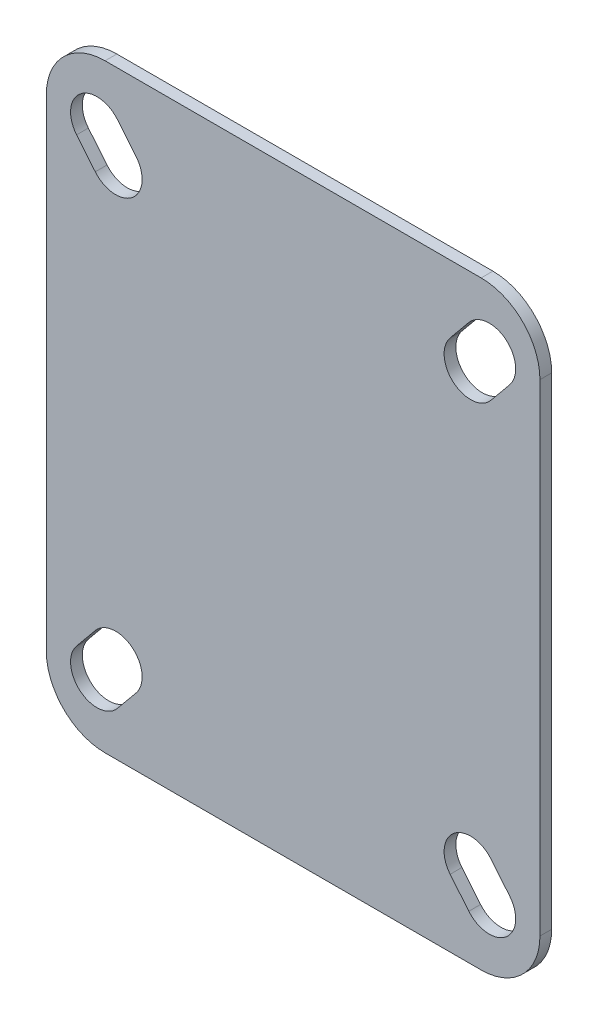
ISO-10303-21;
HEADER;
FILE_DESCRIPTION(('STEP AP214'),'2;1');
FILE_NAME('part.step','',(''),(''),'','','');
FILE_SCHEMA(('AUTOMOTIVE_DESIGN { 1 0 10303 214 1 1 1 1 }'));
ENDSEC;
DATA;
#1=APPLICATION_CONTEXT('core data for automotive mechanical design processes');
#2=APPLICATION_PROTOCOL_DEFINITION('international standard','automotive_design',2000,#1);
#3=PRODUCT_CONTEXT('',#1,'mechanical');
#4=PRODUCT('Part','Part','',(#3));
#5=PRODUCT_RELATED_PRODUCT_CATEGORY('part','',(#4));
#6=PRODUCT_DEFINITION_FORMATION('','',#4);
#7=PRODUCT_DEFINITION_CONTEXT('part definition',#1,'design');
#8=PRODUCT_DEFINITION('design','',#6,#7);
#9=PRODUCT_DEFINITION_SHAPE('','',#8);
#10=(LENGTH_UNIT() NAMED_UNIT(*) SI_UNIT(.MILLI.,.METRE.));
#11=(NAMED_UNIT(*) PLANE_ANGLE_UNIT() SI_UNIT($,.RADIAN.));
#12=(NAMED_UNIT(*) SI_UNIT($,.STERADIAN.) SOLID_ANGLE_UNIT());
#13=UNCERTAINTY_MEASURE_WITH_UNIT(LENGTH_MEASURE(1.E-05),#10,'distance_accuracy_value','');
#14=(GEOMETRIC_REPRESENTATION_CONTEXT(3) GLOBAL_UNCERTAINTY_ASSIGNED_CONTEXT((#13)) GLOBAL_UNIT_ASSIGNED_CONTEXT((#10,
#11,#12)) REPRESENTATION_CONTEXT('',''));
#15=CARTESIAN_POINT('',(0.,0.,0.));
#16=DIRECTION('',(0.,0.,1.));
#17=DIRECTION('',(1.,0.,0.));
#18=AXIS2_PLACEMENT_3D('',#15,#16,#17);
#19=CARTESIAN_POINT('',(0.,27.7552809045647,0.));
#20=DIRECTION('',(0.,0.,1.));
#21=DIRECTION('',(1.,0.,0.));
#22=AXIS2_PLACEMENT_3D('',#19,#20,#21);
#23=CONICAL_SURFACE('',#22,27.4999999999999,0.279252680319093);
#24=CARTESIAN_POINT('',(0.,27.7552809045647,6.));
#25=DIRECTION('',(0.,0.,1.));
#26=DIRECTION('',(1.,0.,0.));
#27=AXIS2_PLACEMENT_3D('',#24,#25,#26);
#28=CIRCLE('',#27,29.2204723145527);
#29=CARTESIAN_POINT('',(29.2204723145527,27.7552809045647,6.));
#30=VERTEX_POINT('',#29);
#31=EDGE_CURVE('E13',#30,#30,#28,.T.);
#32=ORIENTED_EDGE('',*,*,#31,.F.);
#33=EDGE_LOOP('',(#32));
#34=FACE_BOUND('',#33,.T.);
#35=CARTESIAN_POINT('',(0.,27.7552809045647,0.));
#36=DIRECTION('',(0.,0.,1.));
#37=DIRECTION('',(1.,0.,0.));
#38=AXIS2_PLACEMENT_3D('',#35,#36,#37);
#39=CIRCLE('',#38,27.4999999999999);
#40=CARTESIAN_POINT('',(27.4999999999999,27.7552809045647,0.));
#41=VERTEX_POINT('',#40);
#42=EDGE_CURVE('E53',#41,#41,#39,.T.);
#43=ORIENTED_EDGE('',*,*,#42,.T.);
#44=EDGE_LOOP('',(#43));
#45=FACE_BOUND('',#44,.T.);
#46=ADVANCED_FACE('F46',(#34,#45),#23,.T.);
#47=CARTESIAN_POINT('',(0.,27.7552809045647,0.));
#48=DIRECTION('',(0.,0.,1.));
#49=DIRECTION('',(1.,0.,0.));
#50=AXIS2_PLACEMENT_3D('',#47,#48,#49);
#51=PLANE('',#50);
#52=ORIENTED_EDGE('',*,*,#42,.F.);
#53=EDGE_LOOP('',(#52));
#54=FACE_BOUND('',#53,.T.);
#55=ADVANCED_FACE('F396',(#54),#51,.F.);
#56=CARTESIAN_POINT('',(-32.,68.7552809045647,8.));
#57=DIRECTION('',(0.,0.,1.));
#58=DIRECTION('',(1.,0.,0.));
#59=AXIS2_PLACEMENT_3D('',#56,#57,#58);
#60=PLANE('',#59);
#61=CARTESIAN_POINT('',(-32.,68.7552809045647,8.));
#62=DIRECTION('',(0.,0.,1.));
#63=DIRECTION('',(1.,0.,0.));
#64=AXIS2_PLACEMENT_3D('',#61,#62,#63);
#65=CIRCLE('',#64,9.99999999999999);
#66=CARTESIAN_POINT('',(-32.,78.7552809045646,8.));
#67=VERTEX_POINT('',#66);
#68=CARTESIAN_POINT('',(-42.,68.7552809045647,8.));
#69=VERTEX_POINT('',#68);
#70=EDGE_CURVE('E336',#67,#69,#65,.T.);
#71=ORIENTED_EDGE('',*,*,#70,.T.);
#72=DIRECTION('',(0.,-1.,0.));
#73=VECTOR('',#72,1.);
#74=CARTESIAN_POINT('',(-42.,68.7552809045647,8.));
#75=LINE('',#74,#73);
#76=CARTESIAN_POINT('',(-42.,-13.2447190954353,8.));
#77=VERTEX_POINT('',#76);
#78=EDGE_CURVE('E339',#69,#77,#75,.T.);
#79=ORIENTED_EDGE('',*,*,#78,.T.);
#80=CARTESIAN_POINT('',(-32.,-13.2447190954353,8.));
#81=DIRECTION('',(0.,0.,1.));
#82=DIRECTION('',(1.,0.,0.));
#83=AXIS2_PLACEMENT_3D('',#80,#81,#82);
#84=CIRCLE('',#83,10.);
#85=CARTESIAN_POINT('',(-32.,-23.2447190954353,8.));
#86=VERTEX_POINT('',#85);
#87=EDGE_CURVE('E342',#77,#86,#84,.T.);
#88=ORIENTED_EDGE('',*,*,#87,.T.);
#89=DIRECTION('',(1.,0.,0.));
#90=VECTOR('',#89,1.);
#91=CARTESIAN_POINT('',(-32.,-23.2447190954353,8.));
#92=LINE('',#91,#90);
#93=CARTESIAN_POINT('',(32.,-23.2447190954353,8.));
#94=VERTEX_POINT('',#93);
#95=EDGE_CURVE('E344',#86,#94,#92,.T.);
#96=ORIENTED_EDGE('',*,*,#95,.T.);
#97=CARTESIAN_POINT('',(32.,-13.2447190954353,8.));
#98=DIRECTION('',(0.,0.,1.));
#99=DIRECTION('',(1.,0.,0.));
#100=AXIS2_PLACEMENT_3D('',#97,#98,#99);
#101=CIRCLE('',#100,10.);
#102=CARTESIAN_POINT('',(42.,-13.2447190954353,8.));
#103=VERTEX_POINT('',#102);
#104=EDGE_CURVE('E346',#94,#103,#101,.T.);
#105=ORIENTED_EDGE('',*,*,#104,.T.);
#106=DIRECTION('',(0.,1.,0.));
#107=VECTOR('',#106,1.);
#108=CARTESIAN_POINT('',(42.,68.7552809045647,8.));
#109=LINE('',#108,#107);
#110=CARTESIAN_POINT('',(42.,68.7552809045647,8.));
#111=VERTEX_POINT('',#110);
#112=EDGE_CURVE('E348',#103,#111,#109,.T.);
#113=ORIENTED_EDGE('',*,*,#112,.T.);
#114=CARTESIAN_POINT('',(32.,68.7552809045647,8.));
#115=DIRECTION('',(0.,0.,1.));
#116=DIRECTION('',(-1.,0.,0.));
#117=AXIS2_PLACEMENT_3D('',#114,#115,#116);
#118=CIRCLE('',#117,9.99999999999999);
#119=CARTESIAN_POINT('',(32.,78.7552809045646,8.));
#120=VERTEX_POINT('',#119);
#121=EDGE_CURVE('E350',#111,#120,#118,.T.);
#122=ORIENTED_EDGE('',*,*,#121,.T.);
#123=DIRECTION('',(-1.,0.,0.));
#124=VECTOR('',#123,1.);
#125=CARTESIAN_POINT('',(-32.,78.7552809045646,8.));
#126=LINE('',#125,#124);
#127=EDGE_CURVE('E352',#120,#67,#126,.T.);
#128=ORIENTED_EDGE('',*,*,#127,.T.);
#129=EDGE_LOOP('',(#71,#79,#88,#96,#105,#113,#122,#128));
#130=FACE_BOUND('',#129,.T.);
#131=DIRECTION('',(0.635707252861111,-0.77193023561704,0.));
#132=VECTOR('',#131,1.);
#133=CARTESIAN_POINT('',(-36.8483168354845,65.4209356365848,8.));
#134=LINE('',#133,#132);
#135=CARTESIAN_POINT('',(-36.8483168354845,65.4209356365848,8.));
#136=VERTEX_POINT('',#135);
#137=CARTESIAN_POINT('',(-33.669780571179,61.5612844584996,8.));
#138=VERTEX_POINT('',#137);
#139=EDGE_CURVE('E307',#136,#138,#134,.T.);
#140=ORIENTED_EDGE('',*,*,#139,.F.);
#141=CARTESIAN_POINT('',(-33.3746307752077,68.2816182744598,8.));
#142=DIRECTION('',(0.,0.,1.));
#143=DIRECTION('',(1.,0.,0.));
#144=AXIS2_PLACEMENT_3D('',#141,#142,#143);
#145=CIRCLE('',#144,4.49999999999997);
#146=CARTESIAN_POINT('',(-29.9009447149311,71.1423009123347,8.));
#147=VERTEX_POINT('',#146);
#148=EDGE_CURVE('E305',#147,#136,#145,.T.);
#149=ORIENTED_EDGE('',*,*,#148,.F.);
#150=DIRECTION('',(-0.635707252861109,0.771930235617042,0.));
#151=VECTOR('',#150,1.);
#152=CARTESIAN_POINT('',(-29.9009447149311,71.1423009123347,8.));
#153=LINE('',#152,#151);
#154=CARTESIAN_POINT('',(-26.7224084506255,67.2826497342495,8.));
#155=VERTEX_POINT('',#154);
#156=EDGE_CURVE('E313',#155,#147,#153,.T.);
#157=ORIENTED_EDGE('',*,*,#156,.F.);
#158=CARTESIAN_POINT('',(-30.1960945109022,64.4219670963745,8.));
#159=DIRECTION('',(0.,0.,1.));
#160=DIRECTION('',(1.,0.,0.));
#161=AXIS2_PLACEMENT_3D('',#158,#159,#160);
#162=CIRCLE('',#161,4.49999999999997);
#163=EDGE_CURVE('E310',#138,#155,#162,.T.);
#164=ORIENTED_EDGE('',*,*,#163,.F.);
#165=EDGE_LOOP('',(#140,#149,#157,#164));
#166=FACE_BOUND('',#165,.T.);
#167=DIRECTION('',(-0.635707252861103,-0.771930235617047,0.));
#168=VECTOR('',#167,1.);
#169=CARTESIAN_POINT('',(29.900944714931,71.1423009123347,8.));
#170=LINE('',#169,#168);
#171=CARTESIAN_POINT('',(29.900944714931,71.1423009123347,8.));
#172=VERTEX_POINT('',#171);
#173=CARTESIAN_POINT('',(26.7224084506255,67.2826497342495,8.));
#174=VERTEX_POINT('',#173);
#175=EDGE_CURVE('E276',#172,#174,#170,.T.);
#176=ORIENTED_EDGE('',*,*,#175,.F.);
#177=CARTESIAN_POINT('',(33.3746307752077,68.2816182744598,8.));
#178=DIRECTION('',(0.,0.,1.));
#179=DIRECTION('',(1.,0.,0.));
#180=AXIS2_PLACEMENT_3D('',#177,#178,#179);
#181=CIRCLE('',#180,4.49999999999999);
#182=CARTESIAN_POINT('',(36.8483168354844,65.4209356365848,8.));
#183=VERTEX_POINT('',#182);
#184=EDGE_CURVE('E274',#183,#172,#181,.T.);
#185=ORIENTED_EDGE('',*,*,#184,.F.);
#186=DIRECTION('',(0.635707252861101,0.771930235617048,0.));
#187=VECTOR('',#186,1.);
#188=CARTESIAN_POINT('',(36.8483168354844,65.4209356365848,8.));
#189=LINE('',#188,#187);
#190=CARTESIAN_POINT('',(33.6697805711789,61.5612844584996,8.));
#191=VERTEX_POINT('',#190);
#192=EDGE_CURVE('E282',#191,#183,#189,.T.);
#193=ORIENTED_EDGE('',*,*,#192,.F.);
#194=CARTESIAN_POINT('',(30.1960945109022,64.4219670963745,8.));
#195=DIRECTION('',(0.,0.,1.));
#196=DIRECTION('',(1.,0.,0.));
#197=AXIS2_PLACEMENT_3D('',#194,#195,#196);
#198=CIRCLE('',#197,4.5);
#199=EDGE_CURVE('E279',#174,#191,#198,.T.);
#200=ORIENTED_EDGE('',*,*,#199,.F.);
#201=EDGE_LOOP('',(#176,#185,#193,#200));
#202=FACE_BOUND('',#201,.T.);
#203=DIRECTION('',(-0.63570725286113,0.771930235617025,0.));
#204=VECTOR('',#203,1.);
#205=CARTESIAN_POINT('',(36.8483168354845,-9.9103738274554,8.));
#206=LINE('',#205,#204);
#207=CARTESIAN_POINT('',(36.8483168354845,-9.9103738274554,8.));
#208=VERTEX_POINT('',#207);
#209=CARTESIAN_POINT('',(33.6697805711789,-6.05072264937023,8.));
#210=VERTEX_POINT('',#209);
#211=EDGE_CURVE('E245',#208,#210,#206,.T.);
#212=ORIENTED_EDGE('',*,*,#211,.F.);
#213=CARTESIAN_POINT('',(33.3746307752077,-12.7710564653304,8.));
#214=DIRECTION('',(0.,0.,1.));
#215=DIRECTION('',(1.,0.,0.));
#216=AXIS2_PLACEMENT_3D('',#213,#214,#215);
#217=CIRCLE('',#216,4.50000000000004);
#218=CARTESIAN_POINT('',(29.900944714931,-15.6317391032053,8.));
#219=VERTEX_POINT('',#218);
#220=EDGE_CURVE('E243',#219,#208,#217,.T.);
#221=ORIENTED_EDGE('',*,*,#220,.F.);
#222=DIRECTION('',(0.635707252861104,-0.771930235617046,0.));
#223=VECTOR('',#222,1.);
#224=CARTESIAN_POINT('',(29.900944714931,-15.6317391032053,8.));
#225=LINE('',#224,#223);
#226=CARTESIAN_POINT('',(26.7224084506255,-11.7720879251201,8.));
#227=VERTEX_POINT('',#226);
#228=EDGE_CURVE('E251',#227,#219,#225,.T.);
#229=ORIENTED_EDGE('',*,*,#228,.F.);
#230=CARTESIAN_POINT('',(30.1960945109022,-8.91140528724514,8.));
#231=DIRECTION('',(0.,0.,1.));
#232=DIRECTION('',(1.,0.,0.));
#233=AXIS2_PLACEMENT_3D('',#230,#231,#232);
#234=CIRCLE('',#233,4.49999999999995);
#235=EDGE_CURVE('E248',#210,#227,#234,.T.);
#236=ORIENTED_EDGE('',*,*,#235,.F.);
#237=EDGE_LOOP('',(#212,#221,#229,#236));
#238=FACE_BOUND('',#237,.T.);
#239=DIRECTION('',(0.635707252861099,0.77193023561705,0.));
#240=VECTOR('',#239,1.);
#241=CARTESIAN_POINT('',(-29.900944714931,-15.6317391032053,8.));
#242=LINE('',#241,#240);
#243=CARTESIAN_POINT('',(-29.900944714931,-15.6317391032053,8.));
#244=VERTEX_POINT('',#243);
#245=CARTESIAN_POINT('',(-26.7224084506255,-11.7720879251201,8.));
#246=VERTEX_POINT('',#245);
#247=EDGE_CURVE('E214',#244,#246,#242,.T.);
#248=ORIENTED_EDGE('',*,*,#247,.F.);
#249=CARTESIAN_POINT('',(-33.3746307752077,-12.7710564653304,8.));
#250=DIRECTION('',(0.,0.,1.));
#251=DIRECTION('',(1.,0.,0.));
#252=AXIS2_PLACEMENT_3D('',#249,#250,#251);
#253=CIRCLE('',#252,4.49999999999998);
#254=CARTESIAN_POINT('',(-36.8483168354844,-9.91037382745546,8.));
#255=VERTEX_POINT('',#254);
#256=EDGE_CURVE('E206',#255,#244,#253,.T.);
#257=ORIENTED_EDGE('',*,*,#256,.F.);
#258=DIRECTION('',(-0.635707252861099,-0.77193023561705,0.));
#259=VECTOR('',#258,1.);
#260=CARTESIAN_POINT('',(-36.8483168354844,-9.91037382745546,8.));
#261=LINE('',#260,#259);
#262=CARTESIAN_POINT('',(-33.6697805711789,-6.05072264937021,8.));
#263=VERTEX_POINT('',#262);
#264=EDGE_CURVE('E229',#263,#255,#261,.T.);
#265=ORIENTED_EDGE('',*,*,#264,.F.);
#266=CARTESIAN_POINT('',(-30.1960945109022,-8.91140528724515,8.));
#267=DIRECTION('',(0.,0.,1.));
#268=DIRECTION('',(1.,0.,0.));
#269=AXIS2_PLACEMENT_3D('',#266,#267,#268);
#270=CIRCLE('',#269,4.49999999999999);
#271=EDGE_CURVE('E227',#246,#263,#270,.T.);
#272=ORIENTED_EDGE('',*,*,#271,.F.);
#273=EDGE_LOOP('',(#248,#257,#265,#272));
#274=FACE_BOUND('',#273,.T.);
#275=ADVANCED_FACE('F226',(#130,#166,#202,#238,#274),#60,.T.);
#276=CARTESIAN_POINT('',(-32.,68.7552809045647,6.));
#277=DIRECTION('',(0.,0.,1.));
#278=DIRECTION('',(1.,0.,0.));
#279=AXIS2_PLACEMENT_3D('',#276,#277,#278);
#280=PLANE('',#279);
#281=ORIENTED_EDGE('',*,*,#31,.T.);
#282=EDGE_LOOP('',(#281));
#283=FACE_BOUND('',#282,.T.);
#284=CARTESIAN_POINT('',(33.3746307752077,-12.7710564653304,6.));
#285=DIRECTION('',(0.,0.,1.));
#286=DIRECTION('',(1.,0.,0.));
#287=AXIS2_PLACEMENT_3D('',#284,#285,#286);
#288=CIRCLE('',#287,4.50000000000004);
#289=CARTESIAN_POINT('',(29.900944714931,-15.6317391032054,6.));
#290=VERTEX_POINT('',#289);
#291=CARTESIAN_POINT('',(36.8483168354845,-9.9103738274554,6.));
#292=VERTEX_POINT('',#291);
#293=EDGE_CURVE('E222',#290,#292,#288,.T.);
#294=ORIENTED_EDGE('',*,*,#293,.T.);
#295=DIRECTION('',(-0.63570725286113,0.771930235617025,0.));
#296=VECTOR('',#295,1.);
#297=CARTESIAN_POINT('',(36.8483168354845,-9.9103738274554,6.));
#298=LINE('',#297,#296);
#299=CARTESIAN_POINT('',(33.6697805711789,-6.05072264937023,6.));
#300=VERTEX_POINT('',#299);
#301=EDGE_CURVE('E256',#292,#300,#298,.T.);
#302=ORIENTED_EDGE('',*,*,#301,.T.);
#303=CARTESIAN_POINT('',(30.1960945109022,-8.91140528724514,6.));
#304=DIRECTION('',(0.,0.,1.));
#305=DIRECTION('',(1.,0.,0.));
#306=AXIS2_PLACEMENT_3D('',#303,#304,#305);
#307=CIRCLE('',#306,4.49999999999995);
#308=CARTESIAN_POINT('',(26.7224084506255,-11.7720879251201,6.));
#309=VERTEX_POINT('',#308);
#310=EDGE_CURVE('E259',#300,#309,#307,.T.);
#311=ORIENTED_EDGE('',*,*,#310,.T.);
#312=DIRECTION('',(0.635707252861104,-0.771930235617046,0.));
#313=VECTOR('',#312,1.);
#314=CARTESIAN_POINT('',(29.900944714931,-15.6317391032053,6.));
#315=LINE('',#314,#313);
#316=EDGE_CURVE('E246',#309,#290,#315,.T.);
#317=ORIENTED_EDGE('',*,*,#316,.T.);
#318=EDGE_LOOP('',(#294,#302,#311,#317));
#319=FACE_BOUND('',#318,.T.);
#320=CARTESIAN_POINT('',(-33.3746307752077,68.2816182744598,6.));
#321=DIRECTION('',(0.,0.,1.));
#322=DIRECTION('',(1.,0.,0.));
#323=AXIS2_PLACEMENT_3D('',#320,#321,#322);
#324=CIRCLE('',#323,4.49999999999997);
#325=CARTESIAN_POINT('',(-29.900944714931,71.1423009123347,6.));
#326=VERTEX_POINT('',#325);
#327=CARTESIAN_POINT('',(-36.8483168354845,65.4209356365848,6.));
#328=VERTEX_POINT('',#327);
#329=EDGE_CURVE('E304',#326,#328,#324,.T.);
#330=ORIENTED_EDGE('',*,*,#329,.T.);
#331=DIRECTION('',(0.635707252861111,-0.77193023561704,0.));
#332=VECTOR('',#331,1.);
#333=CARTESIAN_POINT('',(-36.8483168354845,65.4209356365848,6.));
#334=LINE('',#333,#332);
#335=CARTESIAN_POINT('',(-33.669780571179,61.5612844584996,6.));
#336=VERTEX_POINT('',#335);
#337=EDGE_CURVE('E318',#328,#336,#334,.T.);
#338=ORIENTED_EDGE('',*,*,#337,.T.);
#339=CARTESIAN_POINT('',(-30.1960945109022,64.4219670963745,6.));
#340=DIRECTION('',(0.,0.,1.));
#341=DIRECTION('',(1.,0.,0.));
#342=AXIS2_PLACEMENT_3D('',#339,#340,#341);
#343=CIRCLE('',#342,4.49999999999997);
#344=CARTESIAN_POINT('',(-26.7224084506255,67.2826497342495,6.));
#345=VERTEX_POINT('',#344);
#346=EDGE_CURVE('E321',#336,#345,#343,.T.);
#347=ORIENTED_EDGE('',*,*,#346,.T.);
#348=DIRECTION('',(-0.635707252861109,0.771930235617042,0.));
#349=VECTOR('',#348,1.);
#350=CARTESIAN_POINT('',(-29.9009447149311,71.1423009123347,6.));
#351=LINE('',#350,#349);
#352=EDGE_CURVE('E308',#345,#326,#351,.T.);
#353=ORIENTED_EDGE('',*,*,#352,.T.);
#354=EDGE_LOOP('',(#330,#338,#347,#353));
#355=FACE_BOUND('',#354,.T.);
#356=CARTESIAN_POINT('',(-32.,68.7552809045647,6.));
#357=DIRECTION('',(0.,0.,1.));
#358=DIRECTION('',(1.,0.,0.));
#359=AXIS2_PLACEMENT_3D('',#356,#357,#358);
#360=CIRCLE('',#359,9.99999999999999);
#361=CARTESIAN_POINT('',(-32.,78.7552809045646,6.));
#362=VERTEX_POINT('',#361);
#363=CARTESIAN_POINT('',(-42.,68.7552809045647,6.));
#364=VERTEX_POINT('',#363);
#365=EDGE_CURVE('E335',#362,#364,#360,.T.);
#366=ORIENTED_EDGE('',*,*,#365,.F.);
#367=DIRECTION('',(-1.,0.,0.));
#368=VECTOR('',#367,1.);
#369=CARTESIAN_POINT('',(-32.,78.7552809045646,6.));
#370=LINE('',#369,#368);
#371=CARTESIAN_POINT('',(32.,78.7552809045646,6.));
#372=VERTEX_POINT('',#371);
#373=EDGE_CURVE('E340',#372,#362,#370,.T.);
#374=ORIENTED_EDGE('',*,*,#373,.F.);
#375=CARTESIAN_POINT('',(32.,68.7552809045647,6.));
#376=DIRECTION('',(0.,0.,1.));
#377=DIRECTION('',(-1.,0.,0.));
#378=AXIS2_PLACEMENT_3D('',#375,#376,#377);
#379=CIRCLE('',#378,9.99999999999999);
#380=CARTESIAN_POINT('',(42.,68.7552809045647,6.));
#381=VERTEX_POINT('',#380);
#382=EDGE_CURVE('E367',#381,#372,#379,.T.);
#383=ORIENTED_EDGE('',*,*,#382,.F.);
#384=DIRECTION('',(0.,1.,0.));
#385=VECTOR('',#384,1.);
#386=CARTESIAN_POINT('',(42.,68.7552809045647,6.));
#387=LINE('',#386,#385);
#388=CARTESIAN_POINT('',(42.,-13.2447190954353,6.));
#389=VERTEX_POINT('',#388);
#390=EDGE_CURVE('E365',#389,#381,#387,.T.);
#391=ORIENTED_EDGE('',*,*,#390,.F.);
#392=CARTESIAN_POINT('',(32.,-13.2447190954353,6.));
#393=DIRECTION('',(0.,0.,1.));
#394=DIRECTION('',(1.,0.,0.));
#395=AXIS2_PLACEMENT_3D('',#392,#393,#394);
#396=CIRCLE('',#395,10.);
#397=CARTESIAN_POINT('',(32.,-23.2447190954353,6.));
#398=VERTEX_POINT('',#397);
#399=EDGE_CURVE('E363',#398,#389,#396,.T.);
#400=ORIENTED_EDGE('',*,*,#399,.F.);
#401=DIRECTION('',(1.,0.,0.));
#402=VECTOR('',#401,1.);
#403=CARTESIAN_POINT('',(-32.,-23.2447190954353,6.));
#404=LINE('',#403,#402);
#405=CARTESIAN_POINT('',(-32.,-23.2447190954353,6.));
#406=VERTEX_POINT('',#405);
#407=EDGE_CURVE('E361',#406,#398,#404,.T.);
#408=ORIENTED_EDGE('',*,*,#407,.F.);
#409=CARTESIAN_POINT('',(-32.,-13.2447190954353,6.));
#410=DIRECTION('',(0.,0.,1.));
#411=DIRECTION('',(1.,0.,0.));
#412=AXIS2_PLACEMENT_3D('',#409,#410,#411);
#413=CIRCLE('',#412,10.);
#414=CARTESIAN_POINT('',(-42.,-13.2447190954353,6.));
#415=VERTEX_POINT('',#414);
#416=EDGE_CURVE('E359',#415,#406,#413,.T.);
#417=ORIENTED_EDGE('',*,*,#416,.F.);
#418=DIRECTION('',(0.,-1.,0.));
#419=VECTOR('',#418,1.);
#420=CARTESIAN_POINT('',(-42.,68.7552809045647,6.));
#421=LINE('',#420,#419);
#422=EDGE_CURVE('E357',#364,#415,#421,.T.);
#423=ORIENTED_EDGE('',*,*,#422,.F.);
#424=EDGE_LOOP('',(#366,#374,#383,#391,#400,#408,#417,#423));
#425=FACE_BOUND('',#424,.T.);
#426=CARTESIAN_POINT('',(33.3746307752077,68.2816182744598,6.));
#427=DIRECTION('',(0.,0.,1.));
#428=DIRECTION('',(1.,0.,0.));
#429=AXIS2_PLACEMENT_3D('',#426,#427,#428);
#430=CIRCLE('',#429,4.49999999999999);
#431=CARTESIAN_POINT('',(36.8483168354844,65.4209356365848,6.));
#432=VERTEX_POINT('',#431);
#433=CARTESIAN_POINT('',(29.900944714931,71.1423009123347,6.));
#434=VERTEX_POINT('',#433);
#435=EDGE_CURVE('E273',#432,#434,#430,.T.);
#436=ORIENTED_EDGE('',*,*,#435,.T.);
#437=DIRECTION('',(-0.635707252861103,-0.771930235617047,0.));
#438=VECTOR('',#437,1.);
#439=CARTESIAN_POINT('',(29.900944714931,71.1423009123347,6.));
#440=LINE('',#439,#438);
#441=CARTESIAN_POINT('',(26.7224084506255,67.2826497342495,6.));
#442=VERTEX_POINT('',#441);
#443=EDGE_CURVE('E287',#434,#442,#440,.T.);
#444=ORIENTED_EDGE('',*,*,#443,.T.);
#445=CARTESIAN_POINT('',(30.1960945109022,64.4219670963745,6.));
#446=DIRECTION('',(0.,0.,1.));
#447=DIRECTION('',(1.,0.,0.));
#448=AXIS2_PLACEMENT_3D('',#445,#446,#447);
#449=CIRCLE('',#448,4.5);
#450=CARTESIAN_POINT('',(33.6697805711789,61.5612844584996,6.));
#451=VERTEX_POINT('',#450);
#452=EDGE_CURVE('E290',#442,#451,#449,.T.);
#453=ORIENTED_EDGE('',*,*,#452,.T.);
#454=DIRECTION('',(0.635707252861101,0.771930235617048,0.));
#455=VECTOR('',#454,1.);
#456=CARTESIAN_POINT('',(36.8483168354844,65.4209356365848,6.));
#457=LINE('',#456,#455);
#458=EDGE_CURVE('E277',#451,#432,#457,.T.);
#459=ORIENTED_EDGE('',*,*,#458,.T.);
#460=EDGE_LOOP('',(#436,#444,#453,#459));
#461=FACE_BOUND('',#460,.T.);
#462=CARTESIAN_POINT('',(-33.3746307752077,-12.7710564653304,6.));
#463=DIRECTION('',(0.,0.,1.));
#464=DIRECTION('',(1.,0.,0.));
#465=AXIS2_PLACEMENT_3D('',#462,#463,#464);
#466=CIRCLE('',#465,4.49999999999998);
#467=CARTESIAN_POINT('',(-36.8483168354844,-9.91037382745546,6.));
#468=VERTEX_POINT('',#467);
#469=CARTESIAN_POINT('',(-29.900944714931,-15.6317391032053,6.));
#470=VERTEX_POINT('',#469);
#471=EDGE_CURVE('E68',#468,#470,#466,.T.);
#472=ORIENTED_EDGE('',*,*,#471,.T.);
#473=DIRECTION('',(0.635707252861099,0.77193023561705,0.));
#474=VECTOR('',#473,1.);
#475=CARTESIAN_POINT('',(-29.900944714931,-15.6317391032053,6.));
#476=LINE('',#475,#474);
#477=CARTESIAN_POINT('',(-26.7224084506255,-11.7720879251201,6.));
#478=VERTEX_POINT('',#477);
#479=EDGE_CURVE('E221',#470,#478,#476,.T.);
#480=ORIENTED_EDGE('',*,*,#479,.T.);
#481=CARTESIAN_POINT('',(-30.1960945109022,-8.91140528724515,6.));
#482=DIRECTION('',(0.,0.,1.));
#483=DIRECTION('',(1.,0.,0.));
#484=AXIS2_PLACEMENT_3D('',#481,#482,#483);
#485=CIRCLE('',#484,4.49999999999999);
#486=CARTESIAN_POINT('',(-33.669780571179,-6.05072264937021,6.));
#487=VERTEX_POINT('',#486);
#488=EDGE_CURVE('E235',#478,#487,#485,.T.);
#489=ORIENTED_EDGE('',*,*,#488,.T.);
#490=DIRECTION('',(-0.635707252861099,-0.77193023561705,0.));
#491=VECTOR('',#490,1.);
#492=CARTESIAN_POINT('',(-36.8483168354844,-9.91037382745546,6.));
#493=LINE('',#492,#491);
#494=EDGE_CURVE('E215',#487,#468,#493,.T.);
#495=ORIENTED_EDGE('',*,*,#494,.T.);
#496=EDGE_LOOP('',(#472,#480,#489,#495));
#497=FACE_BOUND('',#496,.T.);
#498=ADVANCED_FACE('F402',(#283,#319,#355,#425,#461,#497),#280,.F.);
#499=CARTESIAN_POINT('',(-32.,68.7552809045647,8.));
#500=DIRECTION('',(0.,0.,-1.));
#501=DIRECTION('',(-1.,0.,0.));
#502=AXIS2_PLACEMENT_3D('',#499,#500,#501);
#503=CYLINDRICAL_SURFACE('',#502,9.99999999999999);
#504=ORIENTED_EDGE('',*,*,#365,.T.);
#505=DIRECTION('',(0.,0.,-1.));
#506=VECTOR('',#505,1.);
#507=CARTESIAN_POINT('',(-42.,68.7552809045647,8.));
#508=LINE('',#507,#506);
#509=EDGE_CURVE('E390',#69,#364,#508,.T.);
#510=ORIENTED_EDGE('',*,*,#509,.F.);
#511=ORIENTED_EDGE('',*,*,#70,.F.);
#512=DIRECTION('',(0.,0.,-1.));
#513=VECTOR('',#512,1.);
#514=CARTESIAN_POINT('',(-32.,78.7552809045646,8.));
#515=LINE('',#514,#513);
#516=EDGE_CURVE('E354',#67,#362,#515,.T.);
#517=ORIENTED_EDGE('',*,*,#516,.T.);
#518=EDGE_LOOP('',(#504,#510,#511,#517));
#519=FACE_BOUND('',#518,.T.);
#520=ADVANCED_FACE('F407',(#519),#503,.T.);
#521=CARTESIAN_POINT('',(-42.,68.7552809045647,8.));
#522=DIRECTION('',(1.,0.,0.));
#523=DIRECTION('',(0.,0.,-1.));
#524=AXIS2_PLACEMENT_3D('',#521,#522,#523);
#525=PLANE('',#524);
#526=ORIENTED_EDGE('',*,*,#422,.T.);
#527=DIRECTION('',(0.,0.,-1.));
#528=VECTOR('',#527,1.);
#529=CARTESIAN_POINT('',(-42.,-13.2447190954353,8.));
#530=LINE('',#529,#528);
#531=EDGE_CURVE('E387',#77,#415,#530,.T.);
#532=ORIENTED_EDGE('',*,*,#531,.F.);
#533=ORIENTED_EDGE('',*,*,#78,.F.);
#534=ORIENTED_EDGE('',*,*,#509,.T.);
#535=EDGE_LOOP('',(#526,#532,#533,#534));
#536=FACE_BOUND('',#535,.T.);
#537=ADVANCED_FACE('F410',(#536),#525,.F.);
#538=CARTESIAN_POINT('',(-32.,-13.2447190954353,8.));
#539=DIRECTION('',(0.,0.,-1.));
#540=DIRECTION('',(-1.,0.,0.));
#541=AXIS2_PLACEMENT_3D('',#538,#539,#540);
#542=CYLINDRICAL_SURFACE('',#541,10.);
#543=ORIENTED_EDGE('',*,*,#416,.T.);
#544=DIRECTION('',(0.,0.,-1.));
#545=VECTOR('',#544,1.);
#546=CARTESIAN_POINT('',(-32.,-23.2447190954353,8.));
#547=LINE('',#546,#545);
#548=EDGE_CURVE('E384',#86,#406,#547,.T.);
#549=ORIENTED_EDGE('',*,*,#548,.F.);
#550=ORIENTED_EDGE('',*,*,#87,.F.);
#551=ORIENTED_EDGE('',*,*,#531,.T.);
#552=EDGE_LOOP('',(#543,#549,#550,#551));
#553=FACE_BOUND('',#552,.T.);
#554=ADVANCED_FACE('F414',(#553),#542,.T.);
#555=CARTESIAN_POINT('',(-32.,-23.2447190954353,8.));
#556=DIRECTION('',(0.,1.,0.));
#557=DIRECTION('',(-1.,0.,0.));
#558=AXIS2_PLACEMENT_3D('',#555,#556,#557);
#559=PLANE('',#558);
#560=ORIENTED_EDGE('',*,*,#407,.T.);
#561=DIRECTION('',(0.,0.,-1.));
#562=VECTOR('',#561,1.);
#563=CARTESIAN_POINT('',(32.,-23.2447190954353,8.));
#564=LINE('',#563,#562);
#565=EDGE_CURVE('E381',#94,#398,#564,.T.);
#566=ORIENTED_EDGE('',*,*,#565,.F.);
#567=ORIENTED_EDGE('',*,*,#95,.F.);
#568=ORIENTED_EDGE('',*,*,#548,.T.);
#569=EDGE_LOOP('',(#560,#566,#567,#568));
#570=FACE_BOUND('',#569,.T.);
#571=ADVANCED_FACE('F418',(#570),#559,.F.);
#572=CARTESIAN_POINT('',(32.,-13.2447190954353,8.));
#573=DIRECTION('',(0.,0.,-1.));
#574=DIRECTION('',(-1.,0.,0.));
#575=AXIS2_PLACEMENT_3D('',#572,#573,#574);
#576=CYLINDRICAL_SURFACE('',#575,10.);
#577=ORIENTED_EDGE('',*,*,#399,.T.);
#578=DIRECTION('',(0.,0.,-1.));
#579=VECTOR('',#578,1.);
#580=CARTESIAN_POINT('',(42.,-13.2447190954353,8.));
#581=LINE('',#580,#579);
#582=EDGE_CURVE('E378',#103,#389,#581,.T.);
#583=ORIENTED_EDGE('',*,*,#582,.F.);
#584=ORIENTED_EDGE('',*,*,#104,.F.);
#585=ORIENTED_EDGE('',*,*,#565,.T.);
#586=EDGE_LOOP('',(#577,#583,#584,#585));
#587=FACE_BOUND('',#586,.T.);
#588=ADVANCED_FACE('F422',(#587),#576,.T.);
#589=CARTESIAN_POINT('',(42.,68.7552809045647,8.));
#590=DIRECTION('',(-1.,0.,0.));
#591=DIRECTION('',(0.,0.,1.));
#592=AXIS2_PLACEMENT_3D('',#589,#590,#591);
#593=PLANE('',#592);
#594=ORIENTED_EDGE('',*,*,#390,.T.);
#595=DIRECTION('',(0.,0.,-1.));
#596=VECTOR('',#595,1.);
#597=CARTESIAN_POINT('',(42.,68.7552809045647,8.));
#598=LINE('',#597,#596);
#599=EDGE_CURVE('E375',#111,#381,#598,.T.);
#600=ORIENTED_EDGE('',*,*,#599,.F.);
#601=ORIENTED_EDGE('',*,*,#112,.F.);
#602=ORIENTED_EDGE('',*,*,#582,.T.);
#603=EDGE_LOOP('',(#594,#600,#601,#602));
#604=FACE_BOUND('',#603,.T.);
#605=ADVANCED_FACE('F426',(#604),#593,.F.);
#606=CARTESIAN_POINT('',(32.,68.7552809045647,8.));
#607=DIRECTION('',(0.,0.,-1.));
#608=DIRECTION('',(-1.,0.,0.));
#609=AXIS2_PLACEMENT_3D('',#606,#607,#608);
#610=CYLINDRICAL_SURFACE('',#609,9.99999999999999);
#611=ORIENTED_EDGE('',*,*,#382,.T.);
#612=DIRECTION('',(0.,0.,-1.));
#613=VECTOR('',#612,1.);
#614=CARTESIAN_POINT('',(32.,78.7552809045646,8.));
#615=LINE('',#614,#613);
#616=EDGE_CURVE('E372',#120,#372,#615,.T.);
#617=ORIENTED_EDGE('',*,*,#616,.F.);
#618=ORIENTED_EDGE('',*,*,#121,.F.);
#619=ORIENTED_EDGE('',*,*,#599,.T.);
#620=EDGE_LOOP('',(#611,#617,#618,#619));
#621=FACE_BOUND('',#620,.T.);
#622=ADVANCED_FACE('F430',(#621),#610,.T.);
#623=CARTESIAN_POINT('',(-32.,78.7552809045646,8.));
#624=DIRECTION('',(0.,-1.,0.));
#625=DIRECTION('',(0.,0.,-1.));
#626=AXIS2_PLACEMENT_3D('',#623,#624,#625);
#627=PLANE('',#626);
#628=ORIENTED_EDGE('',*,*,#373,.T.);
#629=ORIENTED_EDGE('',*,*,#516,.F.);
#630=ORIENTED_EDGE('',*,*,#127,.F.);
#631=ORIENTED_EDGE('',*,*,#616,.T.);
#632=EDGE_LOOP('',(#628,#629,#630,#631));
#633=FACE_BOUND('',#632,.T.);
#634=ADVANCED_FACE('F434',(#633),#627,.F.);
#635=CARTESIAN_POINT('',(-33.3746307752077,68.2816182744598,8.));
#636=DIRECTION('',(0.,0.,-1.));
#637=DIRECTION('',(-1.,0.,0.));
#638=AXIS2_PLACEMENT_3D('',#635,#636,#637);
#639=CYLINDRICAL_SURFACE('',#638,4.49999999999997);
#640=ORIENTED_EDGE('',*,*,#329,.F.);
#641=DIRECTION('',(0.,0.,-1.));
#642=VECTOR('',#641,1.);
#643=CARTESIAN_POINT('',(-29.9009447149311,71.1423009123347,8.));
#644=LINE('',#643,#642);
#645=EDGE_CURVE('E315',#147,#326,#644,.T.);
#646=ORIENTED_EDGE('',*,*,#645,.F.);
#647=ORIENTED_EDGE('',*,*,#148,.T.);
#648=DIRECTION('',(0.,0.,-1.));
#649=VECTOR('',#648,1.);
#650=CARTESIAN_POINT('',(-36.8483168354845,65.4209356365848,8.));
#651=LINE('',#650,#649);
#652=EDGE_CURVE('E332',#136,#328,#651,.T.);
#653=ORIENTED_EDGE('',*,*,#652,.T.);
#654=EDGE_LOOP('',(#640,#646,#647,#653));
#655=FACE_BOUND('',#654,.T.);
#656=ADVANCED_FACE('F438',(#655),#639,.F.);
#657=CARTESIAN_POINT('',(-36.8483168354845,65.4209356365848,8.));
#658=DIRECTION('',(0.77193023561704,0.635707252861111,0.));
#659=DIRECTION('',(-0.635707252861111,0.77193023561704,0.));
#660=AXIS2_PLACEMENT_3D('',#657,#658,#659);
#661=PLANE('',#660);
#662=ORIENTED_EDGE('',*,*,#337,.F.);
#663=ORIENTED_EDGE('',*,*,#652,.F.);
#664=ORIENTED_EDGE('',*,*,#139,.T.);
#665=DIRECTION('',(0.,0.,-1.));
#666=VECTOR('',#665,1.);
#667=CARTESIAN_POINT('',(-33.669780571179,61.5612844584996,8.));
#668=LINE('',#667,#666);
#669=EDGE_CURVE('E330',#138,#336,#668,.T.);
#670=ORIENTED_EDGE('',*,*,#669,.T.);
#671=EDGE_LOOP('',(#662,#663,#664,#670));
#672=FACE_BOUND('',#671,.T.);
#673=ADVANCED_FACE('F445',(#672),#661,.T.);
#674=CARTESIAN_POINT('',(-30.1960945109022,64.4219670963745,8.));
#675=DIRECTION('',(0.,0.,-1.));
#676=DIRECTION('',(-1.,0.,0.));
#677=AXIS2_PLACEMENT_3D('',#674,#675,#676);
#678=CYLINDRICAL_SURFACE('',#677,4.49999999999997);
#679=ORIENTED_EDGE('',*,*,#346,.F.);
#680=ORIENTED_EDGE('',*,*,#669,.F.);
#681=ORIENTED_EDGE('',*,*,#163,.T.);
#682=DIRECTION('',(0.,0.,-1.));
#683=VECTOR('',#682,1.);
#684=CARTESIAN_POINT('',(-26.7224084506255,67.2826497342495,8.));
#685=LINE('',#684,#683);
#686=EDGE_CURVE('E328',#155,#345,#685,.T.);
#687=ORIENTED_EDGE('',*,*,#686,.T.);
#688=EDGE_LOOP('',(#679,#680,#681,#687));
#689=FACE_BOUND('',#688,.T.);
#690=ADVANCED_FACE('F449',(#689),#678,.F.);
#691=CARTESIAN_POINT('',(-29.9009447149311,71.1423009123347,8.));
#692=DIRECTION('',(-0.771930235617042,-0.635707252861109,0.));
#693=DIRECTION('',(0.635707252861109,-0.771930235617042,0.));
#694=AXIS2_PLACEMENT_3D('',#691,#692,#693);
#695=PLANE('',#694);
#696=ORIENTED_EDGE('',*,*,#352,.F.);
#697=ORIENTED_EDGE('',*,*,#686,.F.);
#698=ORIENTED_EDGE('',*,*,#156,.T.);
#699=ORIENTED_EDGE('',*,*,#645,.T.);
#700=EDGE_LOOP('',(#696,#697,#698,#699));
#701=FACE_BOUND('',#700,.T.);
#702=ADVANCED_FACE('F453',(#701),#695,.T.);
#703=CARTESIAN_POINT('',(33.3746307752077,68.2816182744598,8.));
#704=DIRECTION('',(0.,0.,-1.));
#705=DIRECTION('',(-1.,0.,0.));
#706=AXIS2_PLACEMENT_3D('',#703,#704,#705);
#707=CYLINDRICAL_SURFACE('',#706,4.49999999999999);
#708=ORIENTED_EDGE('',*,*,#435,.F.);
#709=DIRECTION('',(0.,0.,-1.));
#710=VECTOR('',#709,1.);
#711=CARTESIAN_POINT('',(36.8483168354844,65.4209356365848,8.));
#712=LINE('',#711,#710);
#713=EDGE_CURVE('E284',#183,#432,#712,.T.);
#714=ORIENTED_EDGE('',*,*,#713,.F.);
#715=ORIENTED_EDGE('',*,*,#184,.T.);
#716=DIRECTION('',(0.,0.,-1.));
#717=VECTOR('',#716,1.);
#718=CARTESIAN_POINT('',(29.900944714931,71.1423009123347,8.));
#719=LINE('',#718,#717);
#720=EDGE_CURVE('E301',#172,#434,#719,.T.);
#721=ORIENTED_EDGE('',*,*,#720,.T.);
#722=EDGE_LOOP('',(#708,#714,#715,#721));
#723=FACE_BOUND('',#722,.T.);
#724=ADVANCED_FACE('F457',(#723),#707,.F.);
#725=CARTESIAN_POINT('',(29.900944714931,71.1423009123347,8.));
#726=DIRECTION('',(0.771930235617047,-0.635707252861103,0.));
#727=DIRECTION('',(0.635707252861103,0.771930235617047,0.));
#728=AXIS2_PLACEMENT_3D('',#725,#726,#727);
#729=PLANE('',#728);
#730=ORIENTED_EDGE('',*,*,#443,.F.);
#731=ORIENTED_EDGE('',*,*,#720,.F.);
#732=ORIENTED_EDGE('',*,*,#175,.T.);
#733=DIRECTION('',(0.,0.,-1.));
#734=VECTOR('',#733,1.);
#735=CARTESIAN_POINT('',(26.7224084506255,67.2826497342495,8.));
#736=LINE('',#735,#734);
#737=EDGE_CURVE('E299',#174,#442,#736,.T.);
#738=ORIENTED_EDGE('',*,*,#737,.T.);
#739=EDGE_LOOP('',(#730,#731,#732,#738));
#740=FACE_BOUND('',#739,.T.);
#741=ADVANCED_FACE('F461',(#740),#729,.T.);
#742=CARTESIAN_POINT('',(30.1960945109022,64.4219670963745,8.));
#743=DIRECTION('',(0.,0.,-1.));
#744=DIRECTION('',(-1.,0.,0.));
#745=AXIS2_PLACEMENT_3D('',#742,#743,#744);
#746=CYLINDRICAL_SURFACE('',#745,4.5);
#747=ORIENTED_EDGE('',*,*,#452,.F.);
#748=ORIENTED_EDGE('',*,*,#737,.F.);
#749=ORIENTED_EDGE('',*,*,#199,.T.);
#750=DIRECTION('',(0.,0.,-1.));
#751=VECTOR('',#750,1.);
#752=CARTESIAN_POINT('',(33.6697805711789,61.5612844584996,8.));
#753=LINE('',#752,#751);
#754=EDGE_CURVE('E297',#191,#451,#753,.T.);
#755=ORIENTED_EDGE('',*,*,#754,.T.);
#756=EDGE_LOOP('',(#747,#748,#749,#755));
#757=FACE_BOUND('',#756,.T.);
#758=ADVANCED_FACE('F465',(#757),#746,.F.);
#759=CARTESIAN_POINT('',(36.8483168354844,65.4209356365848,8.));
#760=DIRECTION('',(-0.771930235617048,0.635707252861101,0.));
#761=DIRECTION('',(-0.635707252861101,-0.771930235617048,0.));
#762=AXIS2_PLACEMENT_3D('',#759,#760,#761);
#763=PLANE('',#762);
#764=ORIENTED_EDGE('',*,*,#458,.F.);
#765=ORIENTED_EDGE('',*,*,#754,.F.);
#766=ORIENTED_EDGE('',*,*,#192,.T.);
#767=ORIENTED_EDGE('',*,*,#713,.T.);
#768=EDGE_LOOP('',(#764,#765,#766,#767));
#769=FACE_BOUND('',#768,.T.);
#770=ADVANCED_FACE('F469',(#769),#763,.T.);
#771=CARTESIAN_POINT('',(33.3746307752077,-12.7710564653304,8.));
#772=DIRECTION('',(0.,0.,-1.));
#773=DIRECTION('',(-1.,0.,0.));
#774=AXIS2_PLACEMENT_3D('',#771,#772,#773);
#775=CYLINDRICAL_SURFACE('',#774,4.50000000000004);
#776=ORIENTED_EDGE('',*,*,#293,.F.);
#777=DIRECTION('',(0.,0.,-1.));
#778=VECTOR('',#777,1.);
#779=CARTESIAN_POINT('',(29.900944714931,-15.6317391032053,8.));
#780=LINE('',#779,#778);
#781=EDGE_CURVE('E253',#219,#290,#780,.T.);
#782=ORIENTED_EDGE('',*,*,#781,.F.);
#783=ORIENTED_EDGE('',*,*,#220,.T.);
#784=DIRECTION('',(0.,0.,-1.));
#785=VECTOR('',#784,1.);
#786=CARTESIAN_POINT('',(36.8483168354845,-9.9103738274554,8.));
#787=LINE('',#786,#785);
#788=EDGE_CURVE('E270',#208,#292,#787,.T.);
#789=ORIENTED_EDGE('',*,*,#788,.T.);
#790=EDGE_LOOP('',(#776,#782,#783,#789));
#791=FACE_BOUND('',#790,.T.);
#792=ADVANCED_FACE('F473',(#791),#775,.F.);
#793=CARTESIAN_POINT('',(36.8483168354845,-9.9103738274554,8.));
#794=DIRECTION('',(-0.771930235617025,-0.63570725286113,0.));
#795=DIRECTION('',(0.63570725286113,-0.771930235617025,0.));
#796=AXIS2_PLACEMENT_3D('',#793,#794,#795);
#797=PLANE('',#796);
#798=ORIENTED_EDGE('',*,*,#301,.F.);
#799=ORIENTED_EDGE('',*,*,#788,.F.);
#800=ORIENTED_EDGE('',*,*,#211,.T.);
#801=DIRECTION('',(0.,0.,-1.));
#802=VECTOR('',#801,1.);
#803=CARTESIAN_POINT('',(33.6697805711789,-6.05072264937023,8.));
#804=LINE('',#803,#802);
#805=EDGE_CURVE('E268',#210,#300,#804,.T.);
#806=ORIENTED_EDGE('',*,*,#805,.T.);
#807=EDGE_LOOP('',(#798,#799,#800,#806));
#808=FACE_BOUND('',#807,.T.);
#809=ADVANCED_FACE('F477',(#808),#797,.T.);
#810=CARTESIAN_POINT('',(30.1960945109022,-8.91140528724514,8.));
#811=DIRECTION('',(0.,0.,-1.));
#812=DIRECTION('',(-1.,0.,0.));
#813=AXIS2_PLACEMENT_3D('',#810,#811,#812);
#814=CYLINDRICAL_SURFACE('',#813,4.49999999999995);
#815=ORIENTED_EDGE('',*,*,#310,.F.);
#816=ORIENTED_EDGE('',*,*,#805,.F.);
#817=ORIENTED_EDGE('',*,*,#235,.T.);
#818=DIRECTION('',(0.,0.,-1.));
#819=VECTOR('',#818,1.);
#820=CARTESIAN_POINT('',(26.7224084506255,-11.7720879251201,8.));
#821=LINE('',#820,#819);
#822=EDGE_CURVE('E266',#227,#309,#821,.T.);
#823=ORIENTED_EDGE('',*,*,#822,.T.);
#824=EDGE_LOOP('',(#815,#816,#817,#823));
#825=FACE_BOUND('',#824,.T.);
#826=ADVANCED_FACE('F481',(#825),#814,.F.);
#827=CARTESIAN_POINT('',(29.900944714931,-15.6317391032053,8.));
#828=DIRECTION('',(0.771930235617046,0.635707252861104,0.));
#829=DIRECTION('',(-0.635707252861104,0.771930235617046,0.));
#830=AXIS2_PLACEMENT_3D('',#827,#828,#829);
#831=PLANE('',#830);
#832=ORIENTED_EDGE('',*,*,#316,.F.);
#833=ORIENTED_EDGE('',*,*,#822,.F.);
#834=ORIENTED_EDGE('',*,*,#228,.T.);
#835=ORIENTED_EDGE('',*,*,#781,.T.);
#836=EDGE_LOOP('',(#832,#833,#834,#835));
#837=FACE_BOUND('',#836,.T.);
#838=ADVANCED_FACE('F485',(#837),#831,.T.);
#839=CARTESIAN_POINT('',(-33.3746307752077,-12.7710564653304,8.));
#840=DIRECTION('',(0.,0.,-1.));
#841=DIRECTION('',(-1.,0.,0.));
#842=AXIS2_PLACEMENT_3D('',#839,#840,#841);
#843=CYLINDRICAL_SURFACE('',#842,4.49999999999998);
#844=ORIENTED_EDGE('',*,*,#471,.F.);
#845=DIRECTION('',(0.,0.,-1.));
#846=VECTOR('',#845,1.);
#847=CARTESIAN_POINT('',(-36.8483168354844,-9.91037382745546,8.));
#848=LINE('',#847,#846);
#849=EDGE_CURVE('E210',#255,#468,#848,.T.);
#850=ORIENTED_EDGE('',*,*,#849,.F.);
#851=ORIENTED_EDGE('',*,*,#256,.T.);
#852=DIRECTION('',(0.,0.,-1.));
#853=VECTOR('',#852,1.);
#854=CARTESIAN_POINT('',(-29.900944714931,-15.6317391032053,8.));
#855=LINE('',#854,#853);
#856=EDGE_CURVE('E209',#244,#470,#855,.T.);
#857=ORIENTED_EDGE('',*,*,#856,.T.);
#858=EDGE_LOOP('',(#844,#850,#851,#857));
#859=FACE_BOUND('',#858,.T.);
#860=ADVANCED_FACE('F208',(#859),#843,.F.);
#861=CARTESIAN_POINT('',(-29.900944714931,-15.6317391032053,8.));
#862=DIRECTION('',(-0.77193023561705,0.635707252861099,0.));
#863=DIRECTION('',(-0.635707252861099,-0.77193023561705,0.));
#864=AXIS2_PLACEMENT_3D('',#861,#862,#863);
#865=PLANE('',#864);
#866=ORIENTED_EDGE('',*,*,#479,.F.);
#867=ORIENTED_EDGE('',*,*,#856,.F.);
#868=ORIENTED_EDGE('',*,*,#247,.T.);
#869=DIRECTION('',(0.,0.,-1.));
#870=VECTOR('',#869,1.);
#871=CARTESIAN_POINT('',(-26.7224084506255,-11.7720879251201,8.));
#872=LINE('',#871,#870);
#873=EDGE_CURVE('E223',#246,#478,#872,.T.);
#874=ORIENTED_EDGE('',*,*,#873,.T.);
#875=EDGE_LOOP('',(#866,#867,#868,#874));
#876=FACE_BOUND('',#875,.T.);
#877=ADVANCED_FACE('F218',(#876),#865,.T.);
#878=CARTESIAN_POINT('',(-30.1960945109022,-8.91140528724515,8.));
#879=DIRECTION('',(0.,0.,-1.));
#880=DIRECTION('',(-1.,0.,0.));
#881=AXIS2_PLACEMENT_3D('',#878,#879,#880);
#882=CYLINDRICAL_SURFACE('',#881,4.49999999999999);
#883=ORIENTED_EDGE('',*,*,#488,.F.);
#884=ORIENTED_EDGE('',*,*,#873,.F.);
#885=ORIENTED_EDGE('',*,*,#271,.T.);
#886=DIRECTION('',(0.,0.,-1.));
#887=VECTOR('',#886,1.);
#888=CARTESIAN_POINT('',(-33.669780571179,-6.05072264937021,8.));
#889=LINE('',#888,#887);
#890=EDGE_CURVE('E60',#263,#487,#889,.T.);
#891=ORIENTED_EDGE('',*,*,#890,.T.);
#892=EDGE_LOOP('',(#883,#884,#885,#891));
#893=FACE_BOUND('',#892,.T.);
#894=ADVANCED_FACE('F494',(#893),#882,.F.);
#895=CARTESIAN_POINT('',(-36.8483168354844,-9.91037382745546,8.));
#896=DIRECTION('',(0.771930235617051,-0.635707252861099,0.));
#897=DIRECTION('',(0.635707252861099,0.771930235617051,0.));
#898=AXIS2_PLACEMENT_3D('',#895,#896,#897);
#899=PLANE('',#898);
#900=ORIENTED_EDGE('',*,*,#494,.F.);
#901=ORIENTED_EDGE('',*,*,#890,.F.);
#902=ORIENTED_EDGE('',*,*,#264,.T.);
#903=ORIENTED_EDGE('',*,*,#849,.T.);
#904=EDGE_LOOP('',(#900,#901,#902,#903));
#905=FACE_BOUND('',#904,.T.);
#906=ADVANCED_FACE('F497',(#905),#899,.T.);
#907=CLOSED_SHELL('',(#46,#55,#275,#498,#520,#537,#554,#571,#588,#605,#622,#634,#656,#673,#690,
#702,#724,#741,#758,#770,#792,#809,#826,#838,#860,#877,#894,#906));
#908=MANIFOLD_SOLID_BREP('B2',#907);
#909=ADVANCED_BREP_SHAPE_REPRESENTATION('',(#18,#908),#14);
#910=SHAPE_DEFINITION_REPRESENTATION(#9,#909);
ENDSEC;
END-ISO-10303-21;
